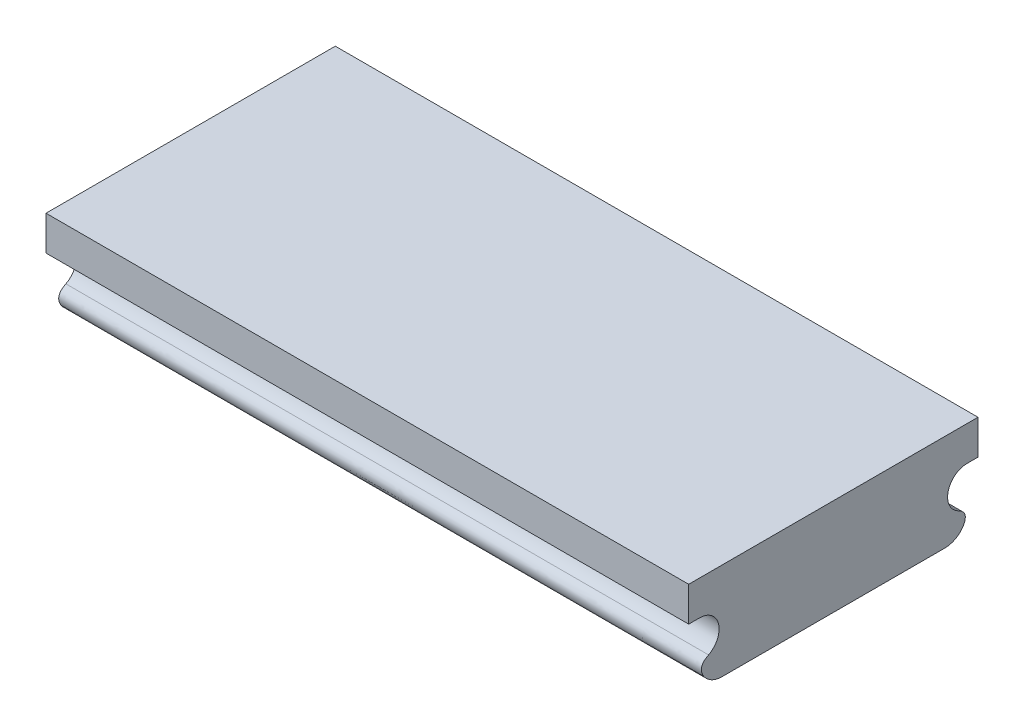
ISO-10303-21;
HEADER;
FILE_DESCRIPTION(('STEP AP214'),'2;1');
FILE_NAME('part.step','',(''),(''),'','','');
FILE_SCHEMA(('AUTOMOTIVE_DESIGN { 1 0 10303 214 1 1 1 1 }'));
ENDSEC;
DATA;
#1=APPLICATION_CONTEXT('core data for automotive mechanical design processes');
#2=APPLICATION_PROTOCOL_DEFINITION('international standard','automotive_design',2000,#1);
#3=PRODUCT_CONTEXT('',#1,'mechanical');
#4=PRODUCT('Part','Part','',(#3));
#5=PRODUCT_RELATED_PRODUCT_CATEGORY('part','',(#4));
#6=PRODUCT_DEFINITION_FORMATION('','',#4);
#7=PRODUCT_DEFINITION_CONTEXT('part definition',#1,'design');
#8=PRODUCT_DEFINITION('design','',#6,#7);
#9=PRODUCT_DEFINITION_SHAPE('','',#8);
#10=(LENGTH_UNIT() NAMED_UNIT(*) SI_UNIT(.MILLI.,.METRE.));
#11=(NAMED_UNIT(*) PLANE_ANGLE_UNIT() SI_UNIT($,.RADIAN.));
#12=(NAMED_UNIT(*) SI_UNIT($,.STERADIAN.) SOLID_ANGLE_UNIT());
#13=UNCERTAINTY_MEASURE_WITH_UNIT(LENGTH_MEASURE(1.E-05),#10,'distance_accuracy_value','');
#14=(GEOMETRIC_REPRESENTATION_CONTEXT(3) GLOBAL_UNCERTAINTY_ASSIGNED_CONTEXT((#13)) GLOBAL_UNIT_ASSIGNED_CONTEXT((#10,
#11,#12)) REPRESENTATION_CONTEXT('',''));
#15=CARTESIAN_POINT('',(0.,0.,0.));
#16=DIRECTION('',(0.,0.,1.));
#17=DIRECTION('',(1.,0.,0.));
#18=AXIS2_PLACEMENT_3D('',#15,#16,#17);
#19=CARTESIAN_POINT('',(73.824999924,7.30249999999999,-12.8058333333333));
#20=DIRECTION('',(-1.,0.,0.));
#21=DIRECTION('',(0.,0.,1.));
#22=AXIS2_PLACEMENT_3D('',#19,#20,#21);
#23=CYLINDRICAL_SURFACE('',#22,2.53999999999999);
#24=CARTESIAN_POINT('',(0.,7.30249999999999,-12.8058333333333));
#25=DIRECTION('',(1.,0.,0.));
#26=DIRECTION('',(0.,0.,-1.));
#27=AXIS2_PLACEMENT_3D('',#24,#25,#26);
#28=CIRCLE('',#27,2.53999999999999);
#29=CARTESIAN_POINT('',(0.,4.76250000000001,-12.8058333333333));
#30=VERTEX_POINT('',#29);
#31=CARTESIAN_POINT('',(0.,5.85528540882681,-14.8932168455551));
#32=VERTEX_POINT('',#31);
#33=EDGE_CURVE('E157',#30,#32,#28,.T.);
#34=ORIENTED_EDGE('',*,*,#33,.T.);
#35=DIRECTION('',(-1.,0.,0.));
#36=VECTOR('',#35,1.);
#37=CARTESIAN_POINT('',(73.824999924,5.85528540882681,-14.8932168455551));
#38=LINE('',#37,#36);
#39=CARTESIAN_POINT('',(73.824999924,5.85528540882681,-14.8932168455551));
#40=VERTEX_POINT('',#39);
#41=EDGE_CURVE('E11',#40,#32,#38,.T.);
#42=ORIENTED_EDGE('',*,*,#41,.F.);
#43=CARTESIAN_POINT('',(73.824999924,7.30249999999999,-12.8058333333333));
#44=DIRECTION('',(1.,0.,0.));
#45=DIRECTION('',(0.,0.,-1.));
#46=AXIS2_PLACEMENT_3D('',#43,#44,#45);
#47=CIRCLE('',#46,2.53999999999999);
#48=CARTESIAN_POINT('',(73.824999924,4.76250000000001,-12.8058333333333));
#49=VERTEX_POINT('',#48);
#50=EDGE_CURVE('E196',#49,#40,#47,.T.);
#51=ORIENTED_EDGE('',*,*,#50,.F.);
#52=DIRECTION('',(-1.,0.,0.));
#53=VECTOR('',#52,1.);
#54=CARTESIAN_POINT('',(73.824999924,4.76250000000001,-12.8058333333333));
#55=LINE('',#54,#53);
#56=EDGE_CURVE('E150',#49,#30,#55,.T.);
#57=ORIENTED_EDGE('',*,*,#56,.T.);
#58=EDGE_LOOP('',(#34,#42,#51,#57));
#59=FACE_BOUND('',#58,.T.);
#60=ADVANCED_FACE('F36',(#59),#23,.T.);
#61=CARTESIAN_POINT('',(73.824999924,5.85528540882682,-14.8932168455551));
#62=CARTESIAN_POINT('',(73.824999924,7.07621565994817,-15.6247728244549));
#63=CARTESIAN_POINT('',(73.824999924,7.7078888343531,-14.3335611044231));
#64=B_SPLINE_CURVE_WITH_KNOTS('',2,(#61,#62,#63),.UNSPECIFIED.,.F.,.F.,(3,3),(0.,1.),.UNSPECIFIED.);
#65=DIRECTION('',(-1.,0.,0.));
#66=VECTOR('',#65,1.);
#67=SURFACE_OF_LINEAR_EXTRUSION('',#64,#66);
#68=CARTESIAN_POINT('',(0.,5.85528540882682,-14.8932168455551));
#69=CARTESIAN_POINT('',(0.,7.07621565994817,-15.6247728244549));
#70=CARTESIAN_POINT('',(0.,7.7078888343531,-14.3335611044231));
#71=B_SPLINE_CURVE_WITH_KNOTS('',2,(#68,#69,#70),.UNSPECIFIED.,.F.,.F.,(3,3),(0.,1.),.UNSPECIFIED.);
#72=CARTESIAN_POINT('',(0.,7.70788883435309,-14.3335611044231));
#73=VERTEX_POINT('',#72);
#74=EDGE_CURVE('E160',#32,#73,#71,.T.);
#75=ORIENTED_EDGE('',*,*,#74,.T.);
#76=DIRECTION('',(-1.,0.,0.));
#77=VECTOR('',#76,1.);
#78=CARTESIAN_POINT('',(73.824999924,7.70788883435309,-14.3335611044231));
#79=LINE('',#78,#77);
#80=CARTESIAN_POINT('',(73.824999924,7.70788883435309,-14.3335611044231));
#81=VERTEX_POINT('',#80);
#82=EDGE_CURVE('E44',#81,#73,#79,.T.);
#83=ORIENTED_EDGE('',*,*,#82,.F.);
#84=EDGE_CURVE('E103',#40,#81,#64,.T.);
#85=ORIENTED_EDGE('',*,*,#84,.F.);
#86=ORIENTED_EDGE('',*,*,#41,.T.);
#87=EDGE_LOOP('',(#75,#83,#85,#86));
#88=FACE_BOUND('',#87,.T.);
#89=ADVANCED_FACE('F262',(#88),#67,.F.);
#90=CARTESIAN_POINT('',(73.824999924,9.68503429144612,-15.3458333333333));
#91=DIRECTION('',(-1.,0.,0.));
#92=DIRECTION('',(0.,0.,1.));
#93=AXIS2_PLACEMENT_3D('',#90,#91,#92);
#94=CYLINDRICAL_SURFACE('',#93,2.22121570855387);
#95=CARTESIAN_POINT('',(0.,9.68503429144612,-15.3458333333333));
#96=DIRECTION('',(1.,0.,0.));
#97=DIRECTION('',(0.,0.,-1.));
#98=AXIS2_PLACEMENT_3D('',#95,#96,#97);
#99=CIRCLE('',#98,2.22121570855387);
#100=CARTESIAN_POINT('',(0.,11.90625,-15.3458333333333));
#101=VERTEX_POINT('',#100);
#102=EDGE_CURVE('E164',#73,#101,#99,.F.);
#103=ORIENTED_EDGE('',*,*,#102,.T.);
#104=DIRECTION('',(-1.,0.,0.));
#105=VECTOR('',#104,1.);
#106=CARTESIAN_POINT('',(73.824999924,11.90625,-15.3458333333333));
#107=LINE('',#106,#105);
#108=CARTESIAN_POINT('',(73.824999924,11.90625,-15.3458333333333));
#109=VERTEX_POINT('',#108);
#110=EDGE_CURVE('E211',#109,#101,#107,.T.);
#111=ORIENTED_EDGE('',*,*,#110,.F.);
#112=CARTESIAN_POINT('',(73.824999924,9.68503429144612,-15.3458333333333));
#113=DIRECTION('',(1.,0.,0.));
#114=DIRECTION('',(0.,0.,-1.));
#115=AXIS2_PLACEMENT_3D('',#112,#113,#114);
#116=CIRCLE('',#115,2.22121570855387);
#117=EDGE_CURVE('E218',#81,#109,#116,.F.);
#118=ORIENTED_EDGE('',*,*,#117,.F.);
#119=ORIENTED_EDGE('',*,*,#82,.T.);
#120=EDGE_LOOP('',(#103,#111,#118,#119));
#121=FACE_BOUND('',#120,.T.);
#122=ADVANCED_FACE('F216',(#121),#94,.F.);
#123=CARTESIAN_POINT('',(73.824999924,11.9062499999999,0.));
#124=DIRECTION('',(0.,-1.,0.));
#125=DIRECTION('',(0.,0.,-1.));
#126=AXIS2_PLACEMENT_3D('',#123,#124,#125);
#127=PLANE('',#126);
#128=DIRECTION('',(0.,0.,1.));
#129=VECTOR('',#128,1.);
#130=CARTESIAN_POINT('',(0.,11.9062499999999,0.));
#131=LINE('',#130,#129);
#132=CARTESIAN_POINT('',(0.,11.90625,-16.6158333333333));
#133=VERTEX_POINT('',#132);
#134=EDGE_CURVE('E170',#133,#101,#131,.T.);
#135=ORIENTED_EDGE('',*,*,#134,.F.);
#136=DIRECTION('',(-1.,0.,0.));
#137=VECTOR('',#136,1.);
#138=CARTESIAN_POINT('',(73.824999924,11.90625,-16.6158333333333));
#139=LINE('',#138,#137);
#140=CARTESIAN_POINT('',(73.824999924,11.90625,-16.6158333333333));
#141=VERTEX_POINT('',#140);
#142=EDGE_CURVE('E209',#141,#133,#139,.T.);
#143=ORIENTED_EDGE('',*,*,#142,.F.);
#144=DIRECTION('',(0.,0.,1.));
#145=VECTOR('',#144,1.);
#146=CARTESIAN_POINT('',(73.824999924,11.9062499999999,0.));
#147=LINE('',#146,#145);
#148=EDGE_CURVE('E228',#141,#109,#147,.T.);
#149=ORIENTED_EDGE('',*,*,#148,.T.);
#150=ORIENTED_EDGE('',*,*,#110,.T.);
#151=EDGE_LOOP('',(#135,#143,#149,#150));
#152=FACE_BOUND('',#151,.T.);
#153=ADVANCED_FACE('F225',(#152),#127,.T.);
#154=CARTESIAN_POINT('',(73.824999924,0.,-16.6158333333333));
#155=DIRECTION('',(0.,0.,-1.));
#156=DIRECTION('',(-1.,0.,0.));
#157=AXIS2_PLACEMENT_3D('',#154,#155,#156);
#158=PLANE('',#157);
#159=DIRECTION('',(0.,-1.,0.));
#160=VECTOR('',#159,1.);
#161=CARTESIAN_POINT('',(0.,0.,-16.6158333333333));
#162=LINE('',#161,#160);
#163=CARTESIAN_POINT('',(0.,15.875,-16.6158333333333));
#164=VERTEX_POINT('',#163);
#165=EDGE_CURVE('E173',#164,#133,#162,.T.);
#166=ORIENTED_EDGE('',*,*,#165,.F.);
#167=DIRECTION('',(-1.,0.,0.));
#168=VECTOR('',#167,1.);
#169=CARTESIAN_POINT('',(73.824999924,15.875,-16.6158333333333));
#170=LINE('',#169,#168);
#171=CARTESIAN_POINT('',(73.824999924,15.875,-16.6158333333333));
#172=VERTEX_POINT('',#171);
#173=EDGE_CURVE('E207',#172,#164,#170,.T.);
#174=ORIENTED_EDGE('',*,*,#173,.F.);
#175=DIRECTION('',(0.,-1.,0.));
#176=VECTOR('',#175,1.);
#177=CARTESIAN_POINT('',(73.824999924,0.,-16.6158333333333));
#178=LINE('',#177,#176);
#179=EDGE_CURVE('E231',#172,#141,#178,.T.);
#180=ORIENTED_EDGE('',*,*,#179,.T.);
#181=ORIENTED_EDGE('',*,*,#142,.T.);
#182=EDGE_LOOP('',(#166,#174,#180,#181));
#183=FACE_BOUND('',#182,.T.);
#184=ADVANCED_FACE('F280',(#183),#158,.T.);
#185=CARTESIAN_POINT('',(73.824999924,15.875,0.));
#186=DIRECTION('',(0.,1.,0.));
#187=DIRECTION('',(0.,0.,1.));
#188=AXIS2_PLACEMENT_3D('',#185,#186,#187);
#189=PLANE('',#188);
#190=DIRECTION('',(0.,0.,-1.));
#191=VECTOR('',#190,1.);
#192=CARTESIAN_POINT('',(0.,15.875,0.));
#193=LINE('',#192,#191);
#194=CARTESIAN_POINT('',(0.,15.875,16.6158333333333));
#195=VERTEX_POINT('',#194);
#196=EDGE_CURVE('E176',#195,#164,#193,.T.);
#197=ORIENTED_EDGE('',*,*,#196,.F.);
#198=DIRECTION('',(-1.,0.,0.));
#199=VECTOR('',#198,1.);
#200=CARTESIAN_POINT('',(73.824999924,15.875,16.6158333333333));
#201=LINE('',#200,#199);
#202=CARTESIAN_POINT('',(73.824999924,15.875,16.6158333333333));
#203=VERTEX_POINT('',#202);
#204=EDGE_CURVE('E205',#203,#195,#201,.T.);
#205=ORIENTED_EDGE('',*,*,#204,.F.);
#206=DIRECTION('',(0.,0.,-1.));
#207=VECTOR('',#206,1.);
#208=CARTESIAN_POINT('',(73.824999924,15.875,0.));
#209=LINE('',#208,#207);
#210=EDGE_CURVE('E233',#203,#172,#209,.T.);
#211=ORIENTED_EDGE('',*,*,#210,.T.);
#212=ORIENTED_EDGE('',*,*,#173,.T.);
#213=EDGE_LOOP('',(#197,#205,#211,#212));
#214=FACE_BOUND('',#213,.T.);
#215=ADVANCED_FACE('F283',(#214),#189,.T.);
#216=CARTESIAN_POINT('',(73.824999924,0.,16.6158333333333));
#217=DIRECTION('',(0.,0.,-1.));
#218=DIRECTION('',(-1.,0.,0.));
#219=AXIS2_PLACEMENT_3D('',#216,#217,#218);
#220=PLANE('',#219);
#221=DIRECTION('',(0.,-1.,0.));
#222=VECTOR('',#221,1.);
#223=CARTESIAN_POINT('',(0.,0.,16.6158333333333));
#224=LINE('',#223,#222);
#225=CARTESIAN_POINT('',(0.,11.90625,16.6158333333333));
#226=VERTEX_POINT('',#225);
#227=EDGE_CURVE('E179',#195,#226,#224,.T.);
#228=ORIENTED_EDGE('',*,*,#227,.T.);
#229=DIRECTION('',(-1.,0.,0.));
#230=VECTOR('',#229,1.);
#231=CARTESIAN_POINT('',(73.824999924,11.90625,16.6158333333333));
#232=LINE('',#231,#230);
#233=CARTESIAN_POINT('',(73.824999924,11.90625,16.6158333333333));
#234=VERTEX_POINT('',#233);
#235=EDGE_CURVE('E202',#234,#226,#232,.T.);
#236=ORIENTED_EDGE('',*,*,#235,.F.);
#237=DIRECTION('',(0.,-1.,0.));
#238=VECTOR('',#237,1.);
#239=CARTESIAN_POINT('',(73.824999924,0.,16.6158333333333));
#240=LINE('',#239,#238);
#241=EDGE_CURVE('E240',#203,#234,#240,.T.);
#242=ORIENTED_EDGE('',*,*,#241,.F.);
#243=ORIENTED_EDGE('',*,*,#204,.T.);
#244=EDGE_LOOP('',(#228,#236,#242,#243));
#245=FACE_BOUND('',#244,.T.);
#246=ADVANCED_FACE('F287',(#245),#220,.F.);
#247=CARTESIAN_POINT('',(73.824999924,11.90625,0.));
#248=DIRECTION('',(0.,1.,0.));
#249=DIRECTION('',(0.,0.,1.));
#250=AXIS2_PLACEMENT_3D('',#247,#248,#249);
#251=PLANE('',#250);
#252=DIRECTION('',(0.,0.,-1.));
#253=VECTOR('',#252,1.);
#254=CARTESIAN_POINT('',(0.,11.90625,0.));
#255=LINE('',#254,#253);
#256=CARTESIAN_POINT('',(0.,11.90625,15.3458333333333));
#257=VERTEX_POINT('',#256);
#258=EDGE_CURVE('E181',#226,#257,#255,.T.);
#259=ORIENTED_EDGE('',*,*,#258,.T.);
#260=DIRECTION('',(-1.,0.,0.));
#261=VECTOR('',#260,1.);
#262=CARTESIAN_POINT('',(73.824999924,11.90625,15.3458333333333));
#263=LINE('',#262,#261);
#264=CARTESIAN_POINT('',(73.824999924,11.90625,15.3458333333333));
#265=VERTEX_POINT('',#264);
#266=EDGE_CURVE('E200',#265,#257,#263,.T.);
#267=ORIENTED_EDGE('',*,*,#266,.F.);
#268=DIRECTION('',(0.,0.,-1.));
#269=VECTOR('',#268,1.);
#270=CARTESIAN_POINT('',(73.824999924,11.90625,0.));
#271=LINE('',#270,#269);
#272=EDGE_CURVE('E242',#234,#265,#271,.T.);
#273=ORIENTED_EDGE('',*,*,#272,.F.);
#274=ORIENTED_EDGE('',*,*,#235,.T.);
#275=EDGE_LOOP('',(#259,#267,#273,#274));
#276=FACE_BOUND('',#275,.T.);
#277=ADVANCED_FACE('F291',(#276),#251,.F.);
#278=CARTESIAN_POINT('',(73.824999924,9.68503429144613,15.3458333333333));
#279=DIRECTION('',(-1.,0.,0.));
#280=DIRECTION('',(0.,0.,1.));
#281=AXIS2_PLACEMENT_3D('',#278,#279,#280);
#282=CYLINDRICAL_SURFACE('',#281,2.22121570855387);
#283=CARTESIAN_POINT('',(0.,9.68503429144613,15.3458333333333));
#284=DIRECTION('',(1.,0.,0.));
#285=DIRECTION('',(0.,0.,-1.));
#286=AXIS2_PLACEMENT_3D('',#283,#284,#285);
#287=CIRCLE('',#286,2.22121570855387);
#288=CARTESIAN_POINT('',(0.,7.7078888343531,14.3335611044231));
#289=VERTEX_POINT('',#288);
#290=EDGE_CURVE('E184',#289,#257,#287,.T.);
#291=ORIENTED_EDGE('',*,*,#290,.F.);
#292=DIRECTION('',(-1.,0.,0.));
#293=VECTOR('',#292,1.);
#294=CARTESIAN_POINT('',(73.824999924,7.7078888343531,14.3335611044231));
#295=LINE('',#294,#293);
#296=CARTESIAN_POINT('',(73.824999924,7.7078888343531,14.3335611044231));
#297=VERTEX_POINT('',#296);
#298=EDGE_CURVE('E140',#297,#289,#295,.T.);
#299=ORIENTED_EDGE('',*,*,#298,.F.);
#300=CARTESIAN_POINT('',(73.824999924,9.68503429144613,15.3458333333333));
#301=DIRECTION('',(1.,0.,0.));
#302=DIRECTION('',(0.,0.,-1.));
#303=AXIS2_PLACEMENT_3D('',#300,#301,#302);
#304=CIRCLE('',#303,2.22121570855387);
#305=EDGE_CURVE('E146',#297,#265,#304,.T.);
#306=ORIENTED_EDGE('',*,*,#305,.T.);
#307=ORIENTED_EDGE('',*,*,#266,.T.);
#308=EDGE_LOOP('',(#291,#299,#306,#307));
#309=FACE_BOUND('',#308,.T.);
#310=ADVANCED_FACE('F245',(#309),#282,.F.);
#311=CARTESIAN_POINT('',(73.824999924,5.85528540882682,14.8932168455551));
#312=CARTESIAN_POINT('',(73.824999924,7.07621565994817,15.6247728244549));
#313=CARTESIAN_POINT('',(73.824999924,7.7078888343531,14.3335611044231));
#314=B_SPLINE_CURVE_WITH_KNOTS('',2,(#311,#312,#313),.UNSPECIFIED.,.F.,.F.,(3,3),(0.,1.),.UNSPECIFIED.);
#315=DIRECTION('',(-1.,0.,0.));
#316=VECTOR('',#315,1.);
#317=SURFACE_OF_LINEAR_EXTRUSION('',#314,#316);
#318=CARTESIAN_POINT('',(0.,5.85528540882682,14.8932168455551));
#319=CARTESIAN_POINT('',(0.,7.07621565994817,15.6247728244549));
#320=CARTESIAN_POINT('',(0.,7.7078888343531,14.3335611044231));
#321=B_SPLINE_CURVE_WITH_KNOTS('',2,(#318,#319,#320),.UNSPECIFIED.,.F.,.F.,(3,3),(0.,1.),.UNSPECIFIED.);
#322=CARTESIAN_POINT('',(0.,5.85528540882682,14.8932168455551));
#323=VERTEX_POINT('',#322);
#324=EDGE_CURVE('E135',#323,#289,#321,.T.);
#325=ORIENTED_EDGE('',*,*,#324,.F.);
#326=DIRECTION('',(-1.,0.,0.));
#327=VECTOR('',#326,1.);
#328=CARTESIAN_POINT('',(73.824999924,5.85528540882682,14.8932168455551));
#329=LINE('',#328,#327);
#330=CARTESIAN_POINT('',(73.824999924,5.85528540882682,14.8932168455551));
#331=VERTEX_POINT('',#330);
#332=EDGE_CURVE('E130',#331,#323,#329,.T.);
#333=ORIENTED_EDGE('',*,*,#332,.F.);
#334=EDGE_CURVE('E133',#331,#297,#314,.T.);
#335=ORIENTED_EDGE('',*,*,#334,.T.);
#336=ORIENTED_EDGE('',*,*,#298,.T.);
#337=EDGE_LOOP('',(#325,#333,#335,#336));
#338=FACE_BOUND('',#337,.T.);
#339=ADVANCED_FACE('F132',(#338),#317,.T.);
#340=CARTESIAN_POINT('',(73.824999924,7.3025,12.8058333333333));
#341=DIRECTION('',(-1.,0.,0.));
#342=DIRECTION('',(0.,0.,1.));
#343=AXIS2_PLACEMENT_3D('',#340,#341,#342);
#344=CYLINDRICAL_SURFACE('',#343,2.54);
#345=CARTESIAN_POINT('',(0.,7.3025,12.8058333333333));
#346=DIRECTION('',(1.,0.,0.));
#347=DIRECTION('',(0.,0.,-1.));
#348=AXIS2_PLACEMENT_3D('',#345,#346,#347);
#349=CIRCLE('',#348,2.54);
#350=CARTESIAN_POINT('',(0.,4.7625,12.8058333333333));
#351=VERTEX_POINT('',#350);
#352=EDGE_CURVE('E190',#351,#323,#349,.F.);
#353=ORIENTED_EDGE('',*,*,#352,.F.);
#354=DIRECTION('',(-1.,0.,0.));
#355=VECTOR('',#354,1.);
#356=CARTESIAN_POINT('',(73.824999924,4.7625,12.8058333333333));
#357=LINE('',#356,#355);
#358=CARTESIAN_POINT('',(73.824999924,4.7625,12.8058333333333));
#359=VERTEX_POINT('',#358);
#360=EDGE_CURVE('E92',#359,#351,#357,.T.);
#361=ORIENTED_EDGE('',*,*,#360,.F.);
#362=CARTESIAN_POINT('',(73.824999924,7.3025,12.8058333333333));
#363=DIRECTION('',(1.,0.,0.));
#364=DIRECTION('',(0.,0.,-1.));
#365=AXIS2_PLACEMENT_3D('',#362,#363,#364);
#366=CIRCLE('',#365,2.54);
#367=EDGE_CURVE('E144',#359,#331,#366,.F.);
#368=ORIENTED_EDGE('',*,*,#367,.T.);
#369=ORIENTED_EDGE('',*,*,#332,.T.);
#370=EDGE_LOOP('',(#353,#361,#368,#369));
#371=FACE_BOUND('',#370,.T.);
#372=ADVANCED_FACE('F148',(#371),#344,.T.);
#373=CARTESIAN_POINT('',(73.824999924,4.7625,0.));
#374=DIRECTION('',(0.,1.,0.));
#375=DIRECTION('',(0.,0.,1.));
#376=AXIS2_PLACEMENT_3D('',#373,#374,#375);
#377=PLANE('',#376);
#378=DIRECTION('',(0.,0.,-1.));
#379=VECTOR('',#378,1.);
#380=CARTESIAN_POINT('',(0.,4.7625,0.));
#381=LINE('',#380,#379);
#382=EDGE_CURVE('E95',#351,#30,#381,.T.);
#383=ORIENTED_EDGE('',*,*,#382,.T.);
#384=ORIENTED_EDGE('',*,*,#56,.F.);
#385=DIRECTION('',(0.,0.,-1.));
#386=VECTOR('',#385,1.);
#387=CARTESIAN_POINT('',(73.824999924,4.7625,0.));
#388=LINE('',#387,#386);
#389=EDGE_CURVE('E52',#359,#49,#388,.T.);
#390=ORIENTED_EDGE('',*,*,#389,.F.);
#391=ORIENTED_EDGE('',*,*,#360,.T.);
#392=EDGE_LOOP('',(#383,#384,#390,#391));
#393=FACE_BOUND('',#392,.T.);
#394=ADVANCED_FACE('F251',(#393),#377,.F.);
#395=CARTESIAN_POINT('',(73.824999924,0.,0.));
#396=DIRECTION('',(1.,0.,0.));
#397=DIRECTION('',(0.,0.,-1.));
#398=AXIS2_PLACEMENT_3D('',#395,#396,#397);
#399=PLANE('',#398);
#400=ORIENTED_EDGE('',*,*,#50,.T.);
#401=ORIENTED_EDGE('',*,*,#84,.T.);
#402=ORIENTED_EDGE('',*,*,#117,.T.);
#403=ORIENTED_EDGE('',*,*,#148,.F.);
#404=ORIENTED_EDGE('',*,*,#179,.F.);
#405=ORIENTED_EDGE('',*,*,#210,.F.);
#406=ORIENTED_EDGE('',*,*,#241,.T.);
#407=ORIENTED_EDGE('',*,*,#272,.T.);
#408=ORIENTED_EDGE('',*,*,#305,.F.);
#409=ORIENTED_EDGE('',*,*,#334,.F.);
#410=ORIENTED_EDGE('',*,*,#367,.F.);
#411=ORIENTED_EDGE('',*,*,#389,.T.);
#412=EDGE_LOOP('',(#400,#401,#402,#403,#404,#405,#406,#407,#408,#409,#410,#411));
#413=FACE_BOUND('',#412,.T.);
#414=ADVANCED_FACE('F143',(#413),#399,.T.);
#415=CARTESIAN_POINT('',(0.,0.,0.));
#416=DIRECTION('',(1.,0.,0.));
#417=DIRECTION('',(0.,0.,-1.));
#418=AXIS2_PLACEMENT_3D('',#415,#416,#417);
#419=PLANE('',#418);
#420=ORIENTED_EDGE('',*,*,#33,.F.);
#421=ORIENTED_EDGE('',*,*,#382,.F.);
#422=ORIENTED_EDGE('',*,*,#352,.T.);
#423=ORIENTED_EDGE('',*,*,#324,.T.);
#424=ORIENTED_EDGE('',*,*,#290,.T.);
#425=ORIENTED_EDGE('',*,*,#258,.F.);
#426=ORIENTED_EDGE('',*,*,#227,.F.);
#427=ORIENTED_EDGE('',*,*,#196,.T.);
#428=ORIENTED_EDGE('',*,*,#165,.T.);
#429=ORIENTED_EDGE('',*,*,#134,.T.);
#430=ORIENTED_EDGE('',*,*,#102,.F.);
#431=ORIENTED_EDGE('',*,*,#74,.F.);
#432=EDGE_LOOP('',(#420,#421,#422,#423,#424,#425,#426,#427,#428,#429,#430,#431));
#433=FACE_BOUND('',#432,.T.);
#434=ADVANCED_FACE('F221',(#433),#419,.F.);
#435=CLOSED_SHELL('',(#60,#89,#122,#153,#184,#215,#246,#277,#310,#339,#372,#394,#414,#434));
#436=MANIFOLD_SOLID_BREP('B2',#435);
#437=ADVANCED_BREP_SHAPE_REPRESENTATION('',(#18,#436),#14);
#438=SHAPE_DEFINITION_REPRESENTATION(#9,#437);
ENDSEC;
END-ISO-10303-21;
